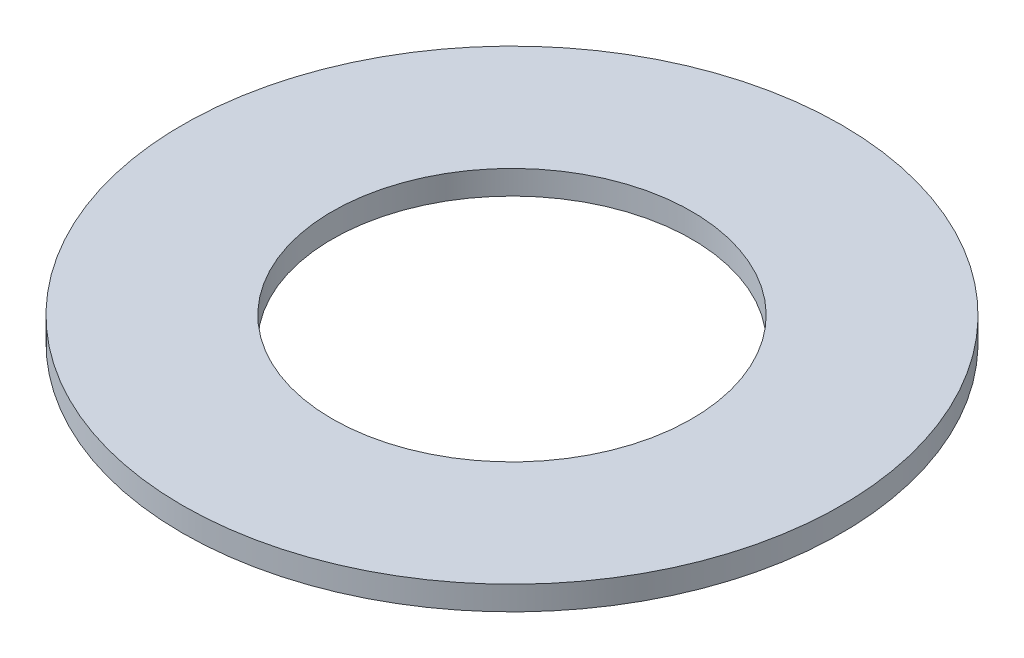
ISO-10303-21;
HEADER;
FILE_DESCRIPTION(('STEP AP214'),'2;1');
FILE_NAME('part.step','',(''),(''),'','','');
FILE_SCHEMA(('AUTOMOTIVE_DESIGN { 1 0 10303 214 1 1 1 1 }'));
ENDSEC;
DATA;
#1=APPLICATION_CONTEXT('core data for automotive mechanical design processes');
#2=APPLICATION_PROTOCOL_DEFINITION('international standard','automotive_design',2000,#1);
#3=PRODUCT_CONTEXT('',#1,'mechanical');
#4=PRODUCT('Part','Part','',(#3));
#5=PRODUCT_RELATED_PRODUCT_CATEGORY('part','',(#4));
#6=PRODUCT_DEFINITION_FORMATION('','',#4);
#7=PRODUCT_DEFINITION_CONTEXT('part definition',#1,'design');
#8=PRODUCT_DEFINITION('design','',#6,#7);
#9=PRODUCT_DEFINITION_SHAPE('','',#8);
#10=(LENGTH_UNIT() NAMED_UNIT(*) SI_UNIT(.MILLI.,.METRE.));
#11=(NAMED_UNIT(*) PLANE_ANGLE_UNIT() SI_UNIT($,.RADIAN.));
#12=(NAMED_UNIT(*) SI_UNIT($,.STERADIAN.) SOLID_ANGLE_UNIT());
#13=UNCERTAINTY_MEASURE_WITH_UNIT(LENGTH_MEASURE(1.E-05),#10,'distance_accuracy_value','');
#14=(GEOMETRIC_REPRESENTATION_CONTEXT(3) GLOBAL_UNCERTAINTY_ASSIGNED_CONTEXT((#13)) GLOBAL_UNIT_ASSIGNED_CONTEXT((#10,
#11,#12)) REPRESENTATION_CONTEXT('',''));
#15=CARTESIAN_POINT('',(0.,0.,0.));
#16=DIRECTION('',(0.,0.,1.));
#17=DIRECTION('',(1.,0.,0.));
#18=AXIS2_PLACEMENT_3D('',#15,#16,#17);
#19=CARTESIAN_POINT('',(0.,2.,0.));
#20=DIRECTION('',(0.,1.,0.));
#21=DIRECTION('',(0.,0.,1.));
#22=AXIS2_PLACEMENT_3D('',#19,#20,#21);
#23=PLANE('',#22);
#24=CARTESIAN_POINT('',(0.,2.,0.));
#25=DIRECTION('',(0.,1.,0.));
#26=DIRECTION('',(0.,0.,1.));
#27=AXIS2_PLACEMENT_3D('',#24,#25,#26);
#28=CIRCLE('',#27,27.5);
#29=CARTESIAN_POINT('',(0.,2.,27.5));
#30=VERTEX_POINT('',#29);
#31=EDGE_CURVE('E10',#30,#30,#28,.T.);
#32=ORIENTED_EDGE('',*,*,#31,.T.);
#33=EDGE_LOOP('',(#32));
#34=FACE_BOUND('',#33,.T.);
#35=CARTESIAN_POINT('',(0.,2.,0.));
#36=DIRECTION('',(0.,1.,0.));
#37=DIRECTION('',(0.,0.,1.));
#38=AXIS2_PLACEMENT_3D('',#35,#36,#37);
#39=CIRCLE('',#38,15.);
#40=CARTESIAN_POINT('',(0.,2.,15.));
#41=VERTEX_POINT('',#40);
#42=EDGE_CURVE('E42',#41,#41,#39,.T.);
#43=ORIENTED_EDGE('',*,*,#42,.F.);
#44=EDGE_LOOP('',(#43));
#45=FACE_BOUND('',#44,.T.);
#46=ADVANCED_FACE('F31',(#34,#45),#23,.T.);
#47=CARTESIAN_POINT('',(0.,0.,0.));
#48=DIRECTION('',(0.,1.,0.));
#49=DIRECTION('',(0.,0.,1.));
#50=AXIS2_PLACEMENT_3D('',#47,#48,#49);
#51=PLANE('',#50);
#52=CARTESIAN_POINT('',(0.,0.,0.));
#53=DIRECTION('',(0.,1.,0.));
#54=DIRECTION('',(0.,0.,1.));
#55=AXIS2_PLACEMENT_3D('',#52,#53,#54);
#56=CIRCLE('',#55,27.5);
#57=CARTESIAN_POINT('',(0.,0.,27.5));
#58=VERTEX_POINT('',#57);
#59=EDGE_CURVE('E35',#58,#58,#56,.T.);
#60=ORIENTED_EDGE('',*,*,#59,.F.);
#61=EDGE_LOOP('',(#60));
#62=FACE_BOUND('',#61,.T.);
#63=CARTESIAN_POINT('',(0.,0.,0.));
#64=DIRECTION('',(0.,1.,0.));
#65=DIRECTION('',(0.,0.,1.));
#66=AXIS2_PLACEMENT_3D('',#63,#64,#65);
#67=CIRCLE('',#66,15.);
#68=CARTESIAN_POINT('',(0.,0.,15.));
#69=VERTEX_POINT('',#68);
#70=EDGE_CURVE('E44',#69,#69,#67,.T.);
#71=ORIENTED_EDGE('',*,*,#70,.T.);
#72=EDGE_LOOP('',(#71));
#73=FACE_BOUND('',#72,.T.);
#74=ADVANCED_FACE('F54',(#62,#73),#51,.F.);
#75=CARTESIAN_POINT('',(0.,2.,0.));
#76=DIRECTION('',(0.,-1.,0.));
#77=DIRECTION('',(0.,0.,-1.));
#78=AXIS2_PLACEMENT_3D('',#75,#76,#77);
#79=CYLINDRICAL_SURFACE('',#78,27.5);
#80=ORIENTED_EDGE('',*,*,#31,.F.);
#81=EDGE_LOOP('',(#80));
#82=FACE_BOUND('',#81,.T.);
#83=ORIENTED_EDGE('',*,*,#59,.T.);
#84=EDGE_LOOP('',(#83));
#85=FACE_BOUND('',#84,.T.);
#86=ADVANCED_FACE('F33',(#82,#85),#79,.T.);
#87=CARTESIAN_POINT('',(0.,2.,0.));
#88=DIRECTION('',(0.,-1.,0.));
#89=DIRECTION('',(0.,0.,-1.));
#90=AXIS2_PLACEMENT_3D('',#87,#88,#89);
#91=CYLINDRICAL_SURFACE('',#90,15.);
#92=ORIENTED_EDGE('',*,*,#42,.T.);
#93=EDGE_LOOP('',(#92));
#94=FACE_BOUND('',#93,.T.);
#95=ORIENTED_EDGE('',*,*,#70,.F.);
#96=EDGE_LOOP('',(#95));
#97=FACE_BOUND('',#96,.T.);
#98=ADVANCED_FACE('F50',(#94,#97),#91,.F.);
#99=CLOSED_SHELL('',(#46,#74,#86,#98));
#100=MANIFOLD_SOLID_BREP('B2',#99);
#101=ADVANCED_BREP_SHAPE_REPRESENTATION('',(#18,#100),#14);
#102=SHAPE_DEFINITION_REPRESENTATION(#9,#101);
ENDSEC;
END-ISO-10303-21;
